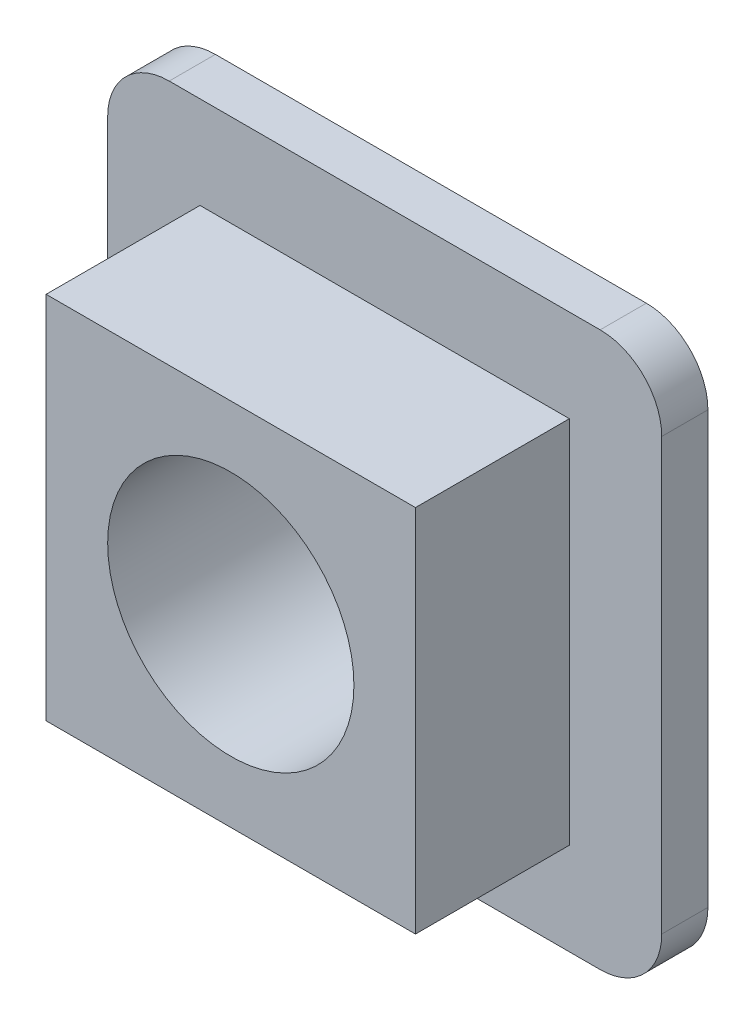
ISO-10303-21;
HEADER;
FILE_DESCRIPTION(('STEP AP214'),'2;1');
FILE_NAME('part.step','',(''),(''),'','','');
FILE_SCHEMA(('AUTOMOTIVE_DESIGN { 1 0 10303 214 1 1 1 1 }'));
ENDSEC;
DATA;
#1=APPLICATION_CONTEXT('core data for automotive mechanical design processes');
#2=APPLICATION_PROTOCOL_DEFINITION('international standard','automotive_design',2000,#1);
#3=PRODUCT_CONTEXT('',#1,'mechanical');
#4=PRODUCT('Part','Part','',(#3));
#5=PRODUCT_RELATED_PRODUCT_CATEGORY('part','',(#4));
#6=PRODUCT_DEFINITION_FORMATION('','',#4);
#7=PRODUCT_DEFINITION_CONTEXT('part definition',#1,'design');
#8=PRODUCT_DEFINITION('design','',#6,#7);
#9=PRODUCT_DEFINITION_SHAPE('','',#8);
#10=(LENGTH_UNIT() NAMED_UNIT(*) SI_UNIT(.MILLI.,.METRE.));
#11=(NAMED_UNIT(*) PLANE_ANGLE_UNIT() SI_UNIT($,.RADIAN.));
#12=(NAMED_UNIT(*) SI_UNIT($,.STERADIAN.) SOLID_ANGLE_UNIT());
#13=UNCERTAINTY_MEASURE_WITH_UNIT(LENGTH_MEASURE(1.E-05),#10,'distance_accuracy_value','');
#14=(GEOMETRIC_REPRESENTATION_CONTEXT(3) GLOBAL_UNCERTAINTY_ASSIGNED_CONTEXT((#13)) GLOBAL_UNIT_ASSIGNED_CONTEXT((#10,
#11,#12)) REPRESENTATION_CONTEXT('',''));
#15=CARTESIAN_POINT('',(0.,0.,0.));
#16=DIRECTION('',(0.,0.,1.));
#17=DIRECTION('',(1.,0.,0.));
#18=AXIS2_PLACEMENT_3D('',#15,#16,#17);
#19=CARTESIAN_POINT('',(16.,16.,1.5));
#20=DIRECTION('',(0.,0.,-1.));
#21=DIRECTION('',(-1.,0.,0.));
#22=AXIS2_PLACEMENT_3D('',#19,#20,#21);
#23=PLANE('',#22);
#24=CARTESIAN_POINT('',(16.,16.,1.5));
#25=DIRECTION('',(0.,0.,1.));
#26=DIRECTION('',(-1.,0.,0.));
#27=AXIS2_PLACEMENT_3D('',#24,#25,#26);
#28=CIRCLE('',#27,2.);
#29=CARTESIAN_POINT('',(18.,16.,1.5));
#30=VERTEX_POINT('',#29);
#31=CARTESIAN_POINT('',(16.,18.,1.5));
#32=VERTEX_POINT('',#31);
#33=EDGE_CURVE('E169',#30,#32,#28,.T.);
#34=ORIENTED_EDGE('',*,*,#33,.T.);
#35=DIRECTION('',(-1.,0.,0.));
#36=VECTOR('',#35,1.);
#37=CARTESIAN_POINT('',(2.00000000000001,18.,1.5));
#38=LINE('',#37,#36);
#39=CARTESIAN_POINT('',(2.00000000000001,18.,1.5));
#40=VERTEX_POINT('',#39);
#41=EDGE_CURVE('E173',#32,#40,#38,.T.);
#42=ORIENTED_EDGE('',*,*,#41,.T.);
#43=CARTESIAN_POINT('',(2.,16.,1.5));
#44=DIRECTION('',(0.,0.,1.));
#45=DIRECTION('',(-1.,0.,0.));
#46=AXIS2_PLACEMENT_3D('',#43,#44,#45);
#47=CIRCLE('',#46,2.);
#48=CARTESIAN_POINT('',(0.,16.,1.5));
#49=VERTEX_POINT('',#48);
#50=EDGE_CURVE('E177',#40,#49,#47,.T.);
#51=ORIENTED_EDGE('',*,*,#50,.T.);
#52=DIRECTION('',(0.,-1.,0.));
#53=VECTOR('',#52,1.);
#54=CARTESIAN_POINT('',(0.,2.00000000000001,1.5));
#55=LINE('',#54,#53);
#56=CARTESIAN_POINT('',(0.,2.00000000000001,1.5));
#57=VERTEX_POINT('',#56);
#58=EDGE_CURVE('E180',#49,#57,#55,.T.);
#59=ORIENTED_EDGE('',*,*,#58,.T.);
#60=CARTESIAN_POINT('',(2.,2.,1.5));
#61=DIRECTION('',(0.,0.,1.));
#62=DIRECTION('',(-1.,0.,0.));
#63=AXIS2_PLACEMENT_3D('',#60,#61,#62);
#64=CIRCLE('',#63,2.);
#65=CARTESIAN_POINT('',(2.00000000000001,0.,1.5));
#66=VERTEX_POINT('',#65);
#67=EDGE_CURVE('E183',#57,#66,#64,.T.);
#68=ORIENTED_EDGE('',*,*,#67,.T.);
#69=DIRECTION('',(1.,0.,0.));
#70=VECTOR('',#69,1.);
#71=CARTESIAN_POINT('',(2.00000000000001,0.,1.5));
#72=LINE('',#71,#70);
#73=CARTESIAN_POINT('',(16.,0.,1.5));
#74=VERTEX_POINT('',#73);
#75=EDGE_CURVE('E186',#66,#74,#72,.T.);
#76=ORIENTED_EDGE('',*,*,#75,.T.);
#77=CARTESIAN_POINT('',(16.,2.,1.5));
#78=DIRECTION('',(0.,0.,1.));
#79=DIRECTION('',(-1.,0.,0.));
#80=AXIS2_PLACEMENT_3D('',#77,#78,#79);
#81=CIRCLE('',#80,2.);
#82=CARTESIAN_POINT('',(18.,2.00000000000001,1.5));
#83=VERTEX_POINT('',#82);
#84=EDGE_CURVE('E189',#74,#83,#81,.T.);
#85=ORIENTED_EDGE('',*,*,#84,.T.);
#86=DIRECTION('',(0.,1.,0.));
#87=VECTOR('',#86,1.);
#88=CARTESIAN_POINT('',(18.,2.00000000000001,1.5));
#89=LINE('',#88,#87);
#90=EDGE_CURVE('E192',#83,#30,#89,.T.);
#91=ORIENTED_EDGE('',*,*,#90,.T.);
#92=EDGE_LOOP('',(#34,#42,#51,#59,#68,#76,#85,#91));
#93=FACE_BOUND('',#92,.T.);
#94=DIRECTION('',(0.,-1.,0.));
#95=VECTOR('',#94,1.);
#96=CARTESIAN_POINT('',(3.,15.,1.5));
#97=LINE('',#96,#95);
#98=CARTESIAN_POINT('',(3.,15.,1.5));
#99=VERTEX_POINT('',#98);
#100=CARTESIAN_POINT('',(3.,3.,1.5));
#101=VERTEX_POINT('',#100);
#102=EDGE_CURVE('E61',#99,#101,#97,.T.);
#103=ORIENTED_EDGE('',*,*,#102,.F.);
#104=DIRECTION('',(-1.,0.,0.));
#105=VECTOR('',#104,1.);
#106=CARTESIAN_POINT('',(3.,15.,1.5));
#107=LINE('',#106,#105);
#108=CARTESIAN_POINT('',(15.,15.,1.5));
#109=VERTEX_POINT('',#108);
#110=EDGE_CURVE('E65',#109,#99,#107,.T.);
#111=ORIENTED_EDGE('',*,*,#110,.F.);
#112=DIRECTION('',(0.,1.,0.));
#113=VECTOR('',#112,1.);
#114=CARTESIAN_POINT('',(15.,15.,1.5));
#115=LINE('',#114,#113);
#116=CARTESIAN_POINT('',(15.,3.,1.5));
#117=VERTEX_POINT('',#116);
#118=EDGE_CURVE('E435',#117,#109,#115,.T.);
#119=ORIENTED_EDGE('',*,*,#118,.F.);
#120=DIRECTION('',(1.,0.,0.));
#121=VECTOR('',#120,1.);
#122=CARTESIAN_POINT('',(3.,3.,1.5));
#123=LINE('',#122,#121);
#124=EDGE_CURVE('E432',#101,#117,#123,.T.);
#125=ORIENTED_EDGE('',*,*,#124,.F.);
#126=EDGE_LOOP('',(#103,#111,#119,#125));
#127=FACE_BOUND('',#126,.T.);
#128=ADVANCED_FACE('F45',(#93,#127),#23,.F.);
#129=CARTESIAN_POINT('',(16.,16.,1.5));
#130=DIRECTION('',(0.,0.,-1.));
#131=DIRECTION('',(-1.,0.,0.));
#132=AXIS2_PLACEMENT_3D('',#129,#130,#131);
#133=CYLINDRICAL_SURFACE('',#132,2.);
#134=CARTESIAN_POINT('',(16.,16.,0.));
#135=DIRECTION('',(0.,0.,1.));
#136=DIRECTION('',(-1.,0.,0.));
#137=AXIS2_PLACEMENT_3D('',#134,#135,#136);
#138=CIRCLE('',#137,2.);
#139=CARTESIAN_POINT('',(18.,16.,0.));
#140=VERTEX_POINT('',#139);
#141=CARTESIAN_POINT('',(16.,18.,0.));
#142=VERTEX_POINT('',#141);
#143=EDGE_CURVE('E158',#140,#142,#138,.T.);
#144=ORIENTED_EDGE('',*,*,#143,.T.);
#145=DIRECTION('',(0.,0.,-1.));
#146=VECTOR('',#145,1.);
#147=CARTESIAN_POINT('',(16.,18.,1.5));
#148=LINE('',#147,#146);
#149=EDGE_CURVE('E11',#32,#142,#148,.T.);
#150=ORIENTED_EDGE('',*,*,#149,.F.);
#151=ORIENTED_EDGE('',*,*,#33,.F.);
#152=DIRECTION('',(0.,0.,-1.));
#153=VECTOR('',#152,1.);
#154=CARTESIAN_POINT('',(18.,16.,1.5));
#155=LINE('',#154,#153);
#156=EDGE_CURVE('E194',#30,#140,#155,.T.);
#157=ORIENTED_EDGE('',*,*,#156,.T.);
#158=EDGE_LOOP('',(#144,#150,#151,#157));
#159=FACE_BOUND('',#158,.T.);
#160=ADVANCED_FACE('F47',(#159),#133,.T.);
#161=CARTESIAN_POINT('',(2.00000000000001,18.,1.5));
#162=DIRECTION('',(0.,-1.,0.));
#163=DIRECTION('',(0.,0.,-1.));
#164=AXIS2_PLACEMENT_3D('',#161,#162,#163);
#165=PLANE('',#164);
#166=DIRECTION('',(-1.,0.,0.));
#167=VECTOR('',#166,1.);
#168=CARTESIAN_POINT('',(2.00000000000001,18.,0.));
#169=LINE('',#168,#167);
#170=CARTESIAN_POINT('',(2.00000000000001,18.,0.));
#171=VERTEX_POINT('',#170);
#172=EDGE_CURVE('E163',#142,#171,#169,.T.);
#173=ORIENTED_EDGE('',*,*,#172,.T.);
#174=DIRECTION('',(0.,0.,-1.));
#175=VECTOR('',#174,1.);
#176=CARTESIAN_POINT('',(2.00000000000001,18.,1.5));
#177=LINE('',#176,#175);
#178=EDGE_CURVE('E54',#40,#171,#177,.T.);
#179=ORIENTED_EDGE('',*,*,#178,.F.);
#180=ORIENTED_EDGE('',*,*,#41,.F.);
#181=ORIENTED_EDGE('',*,*,#149,.T.);
#182=EDGE_LOOP('',(#173,#179,#180,#181));
#183=FACE_BOUND('',#182,.T.);
#184=ADVANCED_FACE('F265',(#183),#165,.F.);
#185=CARTESIAN_POINT('',(2.,16.,1.5));
#186=DIRECTION('',(0.,0.,-1.));
#187=DIRECTION('',(-1.,0.,0.));
#188=AXIS2_PLACEMENT_3D('',#185,#186,#187);
#189=CYLINDRICAL_SURFACE('',#188,2.);
#190=CARTESIAN_POINT('',(2.,16.,0.));
#191=DIRECTION('',(0.,0.,1.));
#192=DIRECTION('',(-1.,0.,0.));
#193=AXIS2_PLACEMENT_3D('',#190,#191,#192);
#194=CIRCLE('',#193,2.);
#195=CARTESIAN_POINT('',(0.,16.,0.));
#196=VERTEX_POINT('',#195);
#197=EDGE_CURVE('E198',#171,#196,#194,.T.);
#198=ORIENTED_EDGE('',*,*,#197,.T.);
#199=DIRECTION('',(0.,0.,-1.));
#200=VECTOR('',#199,1.);
#201=CARTESIAN_POINT('',(0.,16.,1.5));
#202=LINE('',#201,#200);
#203=EDGE_CURVE('E234',#49,#196,#202,.T.);
#204=ORIENTED_EDGE('',*,*,#203,.F.);
#205=ORIENTED_EDGE('',*,*,#50,.F.);
#206=ORIENTED_EDGE('',*,*,#178,.T.);
#207=EDGE_LOOP('',(#198,#204,#205,#206));
#208=FACE_BOUND('',#207,.T.);
#209=ADVANCED_FACE('F243',(#208),#189,.T.);
#210=CARTESIAN_POINT('',(0.,2.00000000000001,1.5));
#211=DIRECTION('',(1.,0.,0.));
#212=DIRECTION('',(0.,0.,-1.));
#213=AXIS2_PLACEMENT_3D('',#210,#211,#212);
#214=PLANE('',#213);
#215=DIRECTION('',(0.,-1.,0.));
#216=VECTOR('',#215,1.);
#217=CARTESIAN_POINT('',(0.,2.00000000000001,0.));
#218=LINE('',#217,#216);
#219=CARTESIAN_POINT('',(0.,2.00000000000001,0.));
#220=VERTEX_POINT('',#219);
#221=EDGE_CURVE('E201',#196,#220,#218,.T.);
#222=ORIENTED_EDGE('',*,*,#221,.T.);
#223=DIRECTION('',(0.,0.,-1.));
#224=VECTOR('',#223,1.);
#225=CARTESIAN_POINT('',(0.,2.00000000000001,1.5));
#226=LINE('',#225,#224);
#227=EDGE_CURVE('E230',#57,#220,#226,.T.);
#228=ORIENTED_EDGE('',*,*,#227,.F.);
#229=ORIENTED_EDGE('',*,*,#58,.F.);
#230=ORIENTED_EDGE('',*,*,#203,.T.);
#231=EDGE_LOOP('',(#222,#228,#229,#230));
#232=FACE_BOUND('',#231,.T.);
#233=ADVANCED_FACE('F254',(#232),#214,.F.);
#234=CARTESIAN_POINT('',(2.,2.,1.5));
#235=DIRECTION('',(0.,0.,-1.));
#236=DIRECTION('',(-1.,0.,0.));
#237=AXIS2_PLACEMENT_3D('',#234,#235,#236);
#238=CYLINDRICAL_SURFACE('',#237,2.);
#239=CARTESIAN_POINT('',(2.,2.,0.));
#240=DIRECTION('',(0.,0.,1.));
#241=DIRECTION('',(-1.,0.,0.));
#242=AXIS2_PLACEMENT_3D('',#239,#240,#241);
#243=CIRCLE('',#242,2.);
#244=CARTESIAN_POINT('',(2.00000000000001,0.,0.));
#245=VERTEX_POINT('',#244);
#246=EDGE_CURVE('E204',#220,#245,#243,.T.);
#247=ORIENTED_EDGE('',*,*,#246,.T.);
#248=DIRECTION('',(0.,0.,-1.));
#249=VECTOR('',#248,1.);
#250=CARTESIAN_POINT('',(2.00000000000001,0.,1.5));
#251=LINE('',#250,#249);
#252=EDGE_CURVE('E226',#66,#245,#251,.T.);
#253=ORIENTED_EDGE('',*,*,#252,.F.);
#254=ORIENTED_EDGE('',*,*,#67,.F.);
#255=ORIENTED_EDGE('',*,*,#227,.T.);
#256=EDGE_LOOP('',(#247,#253,#254,#255));
#257=FACE_BOUND('',#256,.T.);
#258=ADVANCED_FACE('F258',(#257),#238,.T.);
#259=CARTESIAN_POINT('',(2.00000000000001,0.,1.5));
#260=DIRECTION('',(0.,1.,0.));
#261=DIRECTION('',(0.,0.,1.));
#262=AXIS2_PLACEMENT_3D('',#259,#260,#261);
#263=PLANE('',#262);
#264=DIRECTION('',(1.,0.,0.));
#265=VECTOR('',#264,1.);
#266=CARTESIAN_POINT('',(2.00000000000001,0.,0.));
#267=LINE('',#266,#265);
#268=CARTESIAN_POINT('',(16.,0.,0.));
#269=VERTEX_POINT('',#268);
#270=EDGE_CURVE('E207',#245,#269,#267,.T.);
#271=ORIENTED_EDGE('',*,*,#270,.T.);
#272=DIRECTION('',(0.,0.,-1.));
#273=VECTOR('',#272,1.);
#274=CARTESIAN_POINT('',(16.,0.,1.5));
#275=LINE('',#274,#273);
#276=EDGE_CURVE('E222',#74,#269,#275,.T.);
#277=ORIENTED_EDGE('',*,*,#276,.F.);
#278=ORIENTED_EDGE('',*,*,#75,.F.);
#279=ORIENTED_EDGE('',*,*,#252,.T.);
#280=EDGE_LOOP('',(#271,#277,#278,#279));
#281=FACE_BOUND('',#280,.T.);
#282=ADVANCED_FACE('F278',(#281),#263,.F.);
#283=CARTESIAN_POINT('',(16.,2.,1.5));
#284=DIRECTION('',(0.,0.,-1.));
#285=DIRECTION('',(-1.,0.,0.));
#286=AXIS2_PLACEMENT_3D('',#283,#284,#285);
#287=CYLINDRICAL_SURFACE('',#286,2.);
#288=CARTESIAN_POINT('',(16.,2.,0.));
#289=DIRECTION('',(0.,0.,1.));
#290=DIRECTION('',(-1.,0.,0.));
#291=AXIS2_PLACEMENT_3D('',#288,#289,#290);
#292=CIRCLE('',#291,2.);
#293=CARTESIAN_POINT('',(18.,2.00000000000001,0.));
#294=VERTEX_POINT('',#293);
#295=EDGE_CURVE('E210',#269,#294,#292,.T.);
#296=ORIENTED_EDGE('',*,*,#295,.T.);
#297=DIRECTION('',(0.,0.,-1.));
#298=VECTOR('',#297,1.);
#299=CARTESIAN_POINT('',(18.,2.00000000000001,1.5));
#300=LINE('',#299,#298);
#301=EDGE_CURVE('E218',#83,#294,#300,.T.);
#302=ORIENTED_EDGE('',*,*,#301,.F.);
#303=ORIENTED_EDGE('',*,*,#84,.F.);
#304=ORIENTED_EDGE('',*,*,#276,.T.);
#305=EDGE_LOOP('',(#296,#302,#303,#304));
#306=FACE_BOUND('',#305,.T.);
#307=ADVANCED_FACE('F276',(#306),#287,.T.);
#308=CARTESIAN_POINT('',(18.,2.00000000000001,1.5));
#309=DIRECTION('',(-1.,0.,0.));
#310=DIRECTION('',(0.,0.,1.));
#311=AXIS2_PLACEMENT_3D('',#308,#309,#310);
#312=PLANE('',#311);
#313=DIRECTION('',(0.,1.,0.));
#314=VECTOR('',#313,1.);
#315=CARTESIAN_POINT('',(18.,2.00000000000001,0.));
#316=LINE('',#315,#314);
#317=EDGE_CURVE('E174',#294,#140,#316,.T.);
#318=ORIENTED_EDGE('',*,*,#317,.T.);
#319=ORIENTED_EDGE('',*,*,#156,.F.);
#320=ORIENTED_EDGE('',*,*,#90,.F.);
#321=ORIENTED_EDGE('',*,*,#301,.T.);
#322=EDGE_LOOP('',(#318,#319,#320,#321));
#323=FACE_BOUND('',#322,.T.);
#324=ADVANCED_FACE('F271',(#323),#312,.F.);
#325=CARTESIAN_POINT('',(16.,16.,0.));
#326=DIRECTION('',(0.,0.,-1.));
#327=DIRECTION('',(-1.,0.,0.));
#328=AXIS2_PLACEMENT_3D('',#325,#326,#327);
#329=PLANE('',#328);
#330=CARTESIAN_POINT('',(9.,9.,0.));
#331=DIRECTION('',(0.,0.,1.));
#332=DIRECTION('',(1.,0.,0.));
#333=AXIS2_PLACEMENT_3D('',#330,#331,#332);
#334=CIRCLE('',#333,4.);
#335=CARTESIAN_POINT('',(13.,9.,0.));
#336=VERTEX_POINT('',#335);
#337=EDGE_CURVE('E416',#336,#336,#334,.T.);
#338=ORIENTED_EDGE('',*,*,#337,.T.);
#339=EDGE_LOOP('',(#338));
#340=FACE_BOUND('',#339,.T.);
#341=ORIENTED_EDGE('',*,*,#143,.F.);
#342=ORIENTED_EDGE('',*,*,#317,.F.);
#343=ORIENTED_EDGE('',*,*,#295,.F.);
#344=ORIENTED_EDGE('',*,*,#270,.F.);
#345=ORIENTED_EDGE('',*,*,#246,.F.);
#346=ORIENTED_EDGE('',*,*,#221,.F.);
#347=ORIENTED_EDGE('',*,*,#197,.F.);
#348=ORIENTED_EDGE('',*,*,#172,.F.);
#349=EDGE_LOOP('',(#341,#342,#343,#344,#345,#346,#347,#348));
#350=FACE_BOUND('',#349,.T.);
#351=ADVANCED_FACE('F249',(#340,#350),#329,.T.);
#352=CARTESIAN_POINT('',(3.,15.,6.5));
#353=DIRECTION('',(1.,0.,0.));
#354=DIRECTION('',(0.,1.,0.));
#355=AXIS2_PLACEMENT_3D('',#352,#353,#354);
#356=PLANE('',#355);
#357=ORIENTED_EDGE('',*,*,#102,.T.);
#358=DIRECTION('',(0.,0.,-1.));
#359=VECTOR('',#358,1.);
#360=CARTESIAN_POINT('',(3.,3.,6.5));
#361=LINE('',#360,#359);
#362=CARTESIAN_POINT('',(3.,3.,6.5));
#363=VERTEX_POINT('',#362);
#364=EDGE_CURVE('E138',#363,#101,#361,.T.);
#365=ORIENTED_EDGE('',*,*,#364,.F.);
#366=DIRECTION('',(0.,-1.,0.));
#367=VECTOR('',#366,1.);
#368=CARTESIAN_POINT('',(3.,15.,6.5));
#369=LINE('',#368,#367);
#370=CARTESIAN_POINT('',(3.,15.,6.5));
#371=VERTEX_POINT('',#370);
#372=EDGE_CURVE('E145',#371,#363,#369,.T.);
#373=ORIENTED_EDGE('',*,*,#372,.F.);
#374=DIRECTION('',(0.,0.,-1.));
#375=VECTOR('',#374,1.);
#376=CARTESIAN_POINT('',(3.,15.,6.5));
#377=LINE('',#376,#375);
#378=EDGE_CURVE('E429',#371,#99,#377,.T.);
#379=ORIENTED_EDGE('',*,*,#378,.T.);
#380=EDGE_LOOP('',(#357,#365,#373,#379));
#381=FACE_BOUND('',#380,.T.);
#382=ADVANCED_FACE('F156',(#381),#356,.F.);
#383=CARTESIAN_POINT('',(3.,3.,6.5));
#384=DIRECTION('',(0.,1.,0.));
#385=DIRECTION('',(0.,0.,1.));
#386=AXIS2_PLACEMENT_3D('',#383,#384,#385);
#387=PLANE('',#386);
#388=ORIENTED_EDGE('',*,*,#124,.T.);
#389=DIRECTION('',(0.,0.,-1.));
#390=VECTOR('',#389,1.);
#391=CARTESIAN_POINT('',(15.,3.,6.5));
#392=LINE('',#391,#390);
#393=CARTESIAN_POINT('',(15.,3.,6.5));
#394=VERTEX_POINT('',#393);
#395=EDGE_CURVE('E140',#394,#117,#392,.T.);
#396=ORIENTED_EDGE('',*,*,#395,.F.);
#397=DIRECTION('',(1.,0.,0.));
#398=VECTOR('',#397,1.);
#399=CARTESIAN_POINT('',(3.,3.,6.5));
#400=LINE('',#399,#398);
#401=EDGE_CURVE('E133',#363,#394,#400,.T.);
#402=ORIENTED_EDGE('',*,*,#401,.F.);
#403=ORIENTED_EDGE('',*,*,#364,.T.);
#404=EDGE_LOOP('',(#388,#396,#402,#403));
#405=FACE_BOUND('',#404,.T.);
#406=ADVANCED_FACE('F136',(#405),#387,.F.);
#407=CARTESIAN_POINT('',(15.,15.,6.5));
#408=DIRECTION('',(-1.,0.,0.));
#409=DIRECTION('',(0.,0.,1.));
#410=AXIS2_PLACEMENT_3D('',#407,#408,#409);
#411=PLANE('',#410);
#412=ORIENTED_EDGE('',*,*,#118,.T.);
#413=DIRECTION('',(0.,0.,-1.));
#414=VECTOR('',#413,1.);
#415=CARTESIAN_POINT('',(15.,15.,6.5));
#416=LINE('',#415,#414);
#417=CARTESIAN_POINT('',(15.,15.,6.5));
#418=VERTEX_POINT('',#417);
#419=EDGE_CURVE('E165',#418,#109,#416,.T.);
#420=ORIENTED_EDGE('',*,*,#419,.F.);
#421=DIRECTION('',(0.,1.,0.));
#422=VECTOR('',#421,1.);
#423=CARTESIAN_POINT('',(15.,15.,6.5));
#424=LINE('',#423,#422);
#425=EDGE_CURVE('E144',#394,#418,#424,.T.);
#426=ORIENTED_EDGE('',*,*,#425,.F.);
#427=ORIENTED_EDGE('',*,*,#395,.T.);
#428=EDGE_LOOP('',(#412,#420,#426,#427));
#429=FACE_BOUND('',#428,.T.);
#430=ADVANCED_FACE('F370',(#429),#411,.F.);
#431=CARTESIAN_POINT('',(3.,15.,6.5));
#432=DIRECTION('',(0.,-1.,0.));
#433=DIRECTION('',(0.,0.,-1.));
#434=AXIS2_PLACEMENT_3D('',#431,#432,#433);
#435=PLANE('',#434);
#436=ORIENTED_EDGE('',*,*,#110,.T.);
#437=ORIENTED_EDGE('',*,*,#378,.F.);
#438=DIRECTION('',(-1.,0.,0.));
#439=VECTOR('',#438,1.);
#440=CARTESIAN_POINT('',(3.,15.,6.5));
#441=LINE('',#440,#439);
#442=EDGE_CURVE('E150',#418,#371,#441,.T.);
#443=ORIENTED_EDGE('',*,*,#442,.F.);
#444=ORIENTED_EDGE('',*,*,#419,.T.);
#445=EDGE_LOOP('',(#436,#437,#443,#444));
#446=FACE_BOUND('',#445,.T.);
#447=ADVANCED_FACE('F377',(#446),#435,.F.);
#448=CARTESIAN_POINT('',(0.,0.,6.5));
#449=DIRECTION('',(0.,0.,1.));
#450=DIRECTION('',(1.,0.,0.));
#451=AXIS2_PLACEMENT_3D('',#448,#449,#450);
#452=PLANE('',#451);
#453=CARTESIAN_POINT('',(9.,9.,6.5));
#454=DIRECTION('',(0.,0.,1.));
#455=DIRECTION('',(1.,0.,0.));
#456=AXIS2_PLACEMENT_3D('',#453,#454,#455);
#457=CIRCLE('',#456,4.);
#458=CARTESIAN_POINT('',(13.,9.,6.5));
#459=VERTEX_POINT('',#458);
#460=EDGE_CURVE('E419',#459,#459,#457,.T.);
#461=ORIENTED_EDGE('',*,*,#460,.F.);
#462=EDGE_LOOP('',(#461));
#463=FACE_BOUND('',#462,.T.);
#464=ORIENTED_EDGE('',*,*,#372,.T.);
#465=ORIENTED_EDGE('',*,*,#401,.T.);
#466=ORIENTED_EDGE('',*,*,#425,.T.);
#467=ORIENTED_EDGE('',*,*,#442,.T.);
#468=EDGE_LOOP('',(#464,#465,#466,#467));
#469=FACE_BOUND('',#468,.T.);
#470=ADVANCED_FACE('F148',(#463,#469),#452,.T.);
#471=CARTESIAN_POINT('',(9.,9.,0.));
#472=DIRECTION('',(0.,0.,1.));
#473=DIRECTION('',(1.,0.,0.));
#474=AXIS2_PLACEMENT_3D('',#471,#472,#473);
#475=CYLINDRICAL_SURFACE('',#474,4.);
#476=ORIENTED_EDGE('',*,*,#337,.F.);
#477=EDGE_LOOP('',(#476));
#478=FACE_BOUND('',#477,.T.);
#479=ORIENTED_EDGE('',*,*,#460,.T.);
#480=EDGE_LOOP('',(#479));
#481=FACE_BOUND('',#480,.T.);
#482=ADVANCED_FACE('F394',(#478,#481),#475,.F.);
#483=CLOSED_SHELL('',(#128,#160,#184,#209,#233,#258,#282,#307,#324,#351,#382,#406,#430,#447,
#470,#482));
#484=MANIFOLD_SOLID_BREP('B2',#483);
#485=ADVANCED_BREP_SHAPE_REPRESENTATION('',(#18,#484),#14);
#486=SHAPE_DEFINITION_REPRESENTATION(#9,#485);
ENDSEC;
END-ISO-10303-21;
